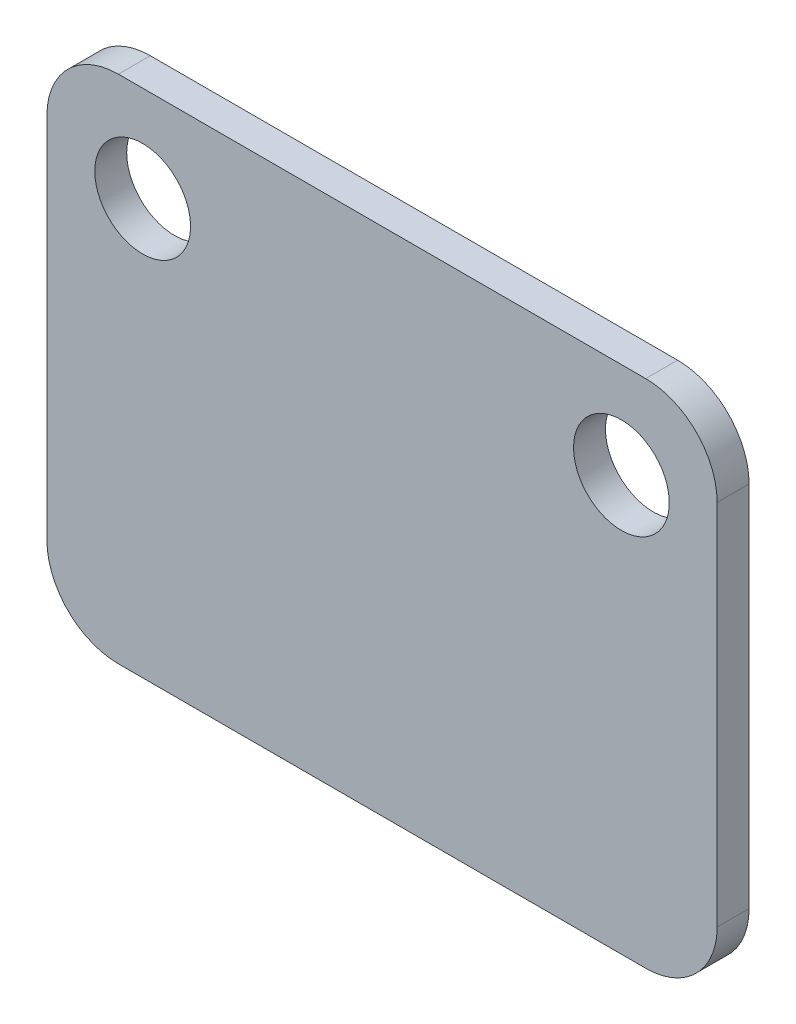
ISO-10303-21;
HEADER;
FILE_DESCRIPTION(('STEP AP214'),'2;1');
FILE_NAME('part.step','',(''),(''),'','','');
FILE_SCHEMA(('AUTOMOTIVE_DESIGN { 1 0 10303 214 1 1 1 1 }'));
ENDSEC;
DATA;
#1=APPLICATION_CONTEXT('core data for automotive mechanical design processes');
#2=APPLICATION_PROTOCOL_DEFINITION('international standard','automotive_design',2000,#1);
#3=PRODUCT_CONTEXT('',#1,'mechanical');
#4=PRODUCT('Part','Part','',(#3));
#5=PRODUCT_RELATED_PRODUCT_CATEGORY('part','',(#4));
#6=PRODUCT_DEFINITION_FORMATION('','',#4);
#7=PRODUCT_DEFINITION_CONTEXT('part definition',#1,'design');
#8=PRODUCT_DEFINITION('design','',#6,#7);
#9=PRODUCT_DEFINITION_SHAPE('','',#8);
#10=(LENGTH_UNIT() NAMED_UNIT(*) SI_UNIT(.MILLI.,.METRE.));
#11=(NAMED_UNIT(*) PLANE_ANGLE_UNIT() SI_UNIT($,.RADIAN.));
#12=(NAMED_UNIT(*) SI_UNIT($,.STERADIAN.) SOLID_ANGLE_UNIT());
#13=UNCERTAINTY_MEASURE_WITH_UNIT(LENGTH_MEASURE(1.E-05),#10,'distance_accuracy_value','');
#14=(GEOMETRIC_REPRESENTATION_CONTEXT(3) GLOBAL_UNCERTAINTY_ASSIGNED_CONTEXT((#13)) GLOBAL_UNIT_ASSIGNED_CONTEXT((#10,
#11,#12)) REPRESENTATION_CONTEXT('',''));
#15=CARTESIAN_POINT('',(0.,0.,0.));
#16=DIRECTION('',(0.,0.,1.));
#17=DIRECTION('',(1.,0.,0.));
#18=AXIS2_PLACEMENT_3D('',#15,#16,#17);
#19=CARTESIAN_POINT('',(71.3519103433022,946.816430092348,1.));
#20=DIRECTION('',(0.,0.,-1.));
#21=DIRECTION('',(-1.,0.,0.));
#22=AXIS2_PLACEMENT_3D('',#19,#20,#21);
#23=CYLINDRICAL_SURFACE('',#22,2.24000000000001);
#24=CARTESIAN_POINT('',(71.3519103433022,946.816430092348,0.));
#25=DIRECTION('',(0.,0.,-1.));
#26=DIRECTION('',(-1.,0.,0.));
#27=AXIS2_PLACEMENT_3D('',#24,#25,#26);
#28=CIRCLE('',#27,2.24000000000001);
#29=CARTESIAN_POINT('',(71.3519103433022,949.056430092348,0.));
#30=VERTEX_POINT('',#29);
#31=CARTESIAN_POINT('',(73.5919103433022,946.816430092348,0.));
#32=VERTEX_POINT('',#31);
#33=EDGE_CURVE('E132',#30,#32,#28,.T.);
#34=ORIENTED_EDGE('',*,*,#33,.F.);
#35=DIRECTION('',(0.,0.,-1.));
#36=VECTOR('',#35,1.);
#37=CARTESIAN_POINT('',(71.3519103433022,949.056430092348,1.));
#38=LINE('',#37,#36);
#39=CARTESIAN_POINT('',(71.3519103433022,949.056430092348,1.));
#40=VERTEX_POINT('',#39);
#41=EDGE_CURVE('E11',#40,#30,#38,.T.);
#42=ORIENTED_EDGE('',*,*,#41,.F.);
#43=CARTESIAN_POINT('',(71.3519103433022,946.816430092348,1.));
#44=DIRECTION('',(0.,0.,-1.));
#45=DIRECTION('',(-1.,0.,0.));
#46=AXIS2_PLACEMENT_3D('',#43,#44,#45);
#47=CIRCLE('',#46,2.24000000000001);
#48=CARTESIAN_POINT('',(73.5919103433022,946.816430092348,1.));
#49=VERTEX_POINT('',#48);
#50=EDGE_CURVE('E151',#40,#49,#47,.T.);
#51=ORIENTED_EDGE('',*,*,#50,.T.);
#52=DIRECTION('',(0.,0.,-1.));
#53=VECTOR('',#52,1.);
#54=CARTESIAN_POINT('',(73.5919103433022,946.816430092348,1.));
#55=LINE('',#54,#53);
#56=EDGE_CURVE('E36',#49,#32,#55,.T.);
#57=ORIENTED_EDGE('',*,*,#56,.T.);
#58=EDGE_LOOP('',(#34,#42,#51,#57));
#59=FACE_BOUND('',#58,.T.);
#60=ADVANCED_FACE('F33',(#59),#23,.T.);
#61=CARTESIAN_POINT('',(71.3519103433022,949.056430092348,1.));
#62=DIRECTION('',(0.,-1.,0.));
#63=DIRECTION('',(0.,0.,-1.));
#64=AXIS2_PLACEMENT_3D('',#61,#62,#63);
#65=PLANE('',#64);
#66=DIRECTION('',(-1.,0.,0.));
#67=VECTOR('',#66,1.);
#68=CARTESIAN_POINT('',(71.3519103433022,949.056430092348,0.));
#69=LINE('',#68,#67);
#70=CARTESIAN_POINT('',(54.8319103433022,949.056430092348,0.));
#71=VERTEX_POINT('',#70);
#72=EDGE_CURVE('E78',#30,#71,#69,.T.);
#73=ORIENTED_EDGE('',*,*,#72,.T.);
#74=DIRECTION('',(0.,0.,-1.));
#75=VECTOR('',#74,1.);
#76=CARTESIAN_POINT('',(54.8319103433022,949.056430092348,1.));
#77=LINE('',#76,#75);
#78=CARTESIAN_POINT('',(54.8319103433022,949.056430092348,1.));
#79=VERTEX_POINT('',#78);
#80=EDGE_CURVE('E42',#79,#71,#77,.T.);
#81=ORIENTED_EDGE('',*,*,#80,.F.);
#82=DIRECTION('',(-1.,0.,0.));
#83=VECTOR('',#82,1.);
#84=CARTESIAN_POINT('',(71.3519103433022,949.056430092348,1.));
#85=LINE('',#84,#83);
#86=EDGE_CURVE('E110',#40,#79,#85,.T.);
#87=ORIENTED_EDGE('',*,*,#86,.F.);
#88=ORIENTED_EDGE('',*,*,#41,.T.);
#89=EDGE_LOOP('',(#73,#81,#87,#88));
#90=FACE_BOUND('',#89,.T.);
#91=ADVANCED_FACE('F213',(#90),#65,.F.);
#92=CARTESIAN_POINT('',(54.8319103433022,946.816430092348,1.));
#93=DIRECTION('',(0.,0.,-1.));
#94=DIRECTION('',(-1.,0.,0.));
#95=AXIS2_PLACEMENT_3D('',#92,#93,#94);
#96=CYLINDRICAL_SURFACE('',#95,2.24000000000001);
#97=CARTESIAN_POINT('',(54.8319103433022,946.816430092348,0.));
#98=DIRECTION('',(0.,0.,1.));
#99=DIRECTION('',(1.,0.,0.));
#100=AXIS2_PLACEMENT_3D('',#97,#98,#99);
#101=CIRCLE('',#100,2.24000000000001);
#102=CARTESIAN_POINT('',(52.5919103433022,946.816430092348,0.));
#103=VERTEX_POINT('',#102);
#104=EDGE_CURVE('E117',#71,#103,#101,.T.);
#105=ORIENTED_EDGE('',*,*,#104,.T.);
#106=DIRECTION('',(0.,0.,-1.));
#107=VECTOR('',#106,1.);
#108=CARTESIAN_POINT('',(52.5919103433022,946.816430092348,1.));
#109=LINE('',#108,#107);
#110=CARTESIAN_POINT('',(52.5919103433022,946.816430092348,1.));
#111=VERTEX_POINT('',#110);
#112=EDGE_CURVE('E114',#111,#103,#109,.T.);
#113=ORIENTED_EDGE('',*,*,#112,.F.);
#114=CARTESIAN_POINT('',(54.8319103433022,946.816430092348,1.));
#115=DIRECTION('',(0.,0.,1.));
#116=DIRECTION('',(1.,0.,0.));
#117=AXIS2_PLACEMENT_3D('',#114,#115,#116);
#118=CIRCLE('',#117,2.24000000000001);
#119=EDGE_CURVE('E102',#79,#111,#118,.T.);
#120=ORIENTED_EDGE('',*,*,#119,.F.);
#121=ORIENTED_EDGE('',*,*,#80,.T.);
#122=EDGE_LOOP('',(#105,#113,#120,#121));
#123=FACE_BOUND('',#122,.T.);
#124=ADVANCED_FACE('F115',(#123),#96,.T.);
#125=CARTESIAN_POINT('',(52.5919103433022,946.816430092348,1.));
#126=DIRECTION('',(1.,0.,0.));
#127=DIRECTION('',(0.,0.,-1.));
#128=AXIS2_PLACEMENT_3D('',#125,#126,#127);
#129=PLANE('',#128);
#130=DIRECTION('',(0.,-1.,0.));
#131=VECTOR('',#130,1.);
#132=CARTESIAN_POINT('',(52.5919103433022,946.816430092348,0.));
#133=LINE('',#132,#131);
#134=CARTESIAN_POINT('',(52.5919103433022,935.296430092348,0.));
#135=VERTEX_POINT('',#134);
#136=EDGE_CURVE('E148',#103,#135,#133,.T.);
#137=ORIENTED_EDGE('',*,*,#136,.T.);
#138=DIRECTION('',(0.,0.,-1.));
#139=VECTOR('',#138,1.);
#140=CARTESIAN_POINT('',(52.5919103433022,935.296430092348,1.));
#141=LINE('',#140,#139);
#142=CARTESIAN_POINT('',(52.5919103433022,935.296430092348,1.));
#143=VERTEX_POINT('',#142);
#144=EDGE_CURVE('E121',#143,#135,#141,.T.);
#145=ORIENTED_EDGE('',*,*,#144,.F.);
#146=DIRECTION('',(0.,-1.,0.));
#147=VECTOR('',#146,1.);
#148=CARTESIAN_POINT('',(52.5919103433022,946.816430092348,1.));
#149=LINE('',#148,#147);
#150=EDGE_CURVE('E108',#111,#143,#149,.T.);
#151=ORIENTED_EDGE('',*,*,#150,.F.);
#152=ORIENTED_EDGE('',*,*,#112,.T.);
#153=EDGE_LOOP('',(#137,#145,#151,#152));
#154=FACE_BOUND('',#153,.T.);
#155=ADVANCED_FACE('F123',(#154),#129,.F.);
#156=CARTESIAN_POINT('',(54.8319103433022,935.296430092348,1.));
#157=DIRECTION('',(0.,0.,-1.));
#158=DIRECTION('',(-1.,0.,0.));
#159=AXIS2_PLACEMENT_3D('',#156,#157,#158);
#160=CYLINDRICAL_SURFACE('',#159,2.24000000000001);
#161=CARTESIAN_POINT('',(54.8319103433022,935.296430092348,0.));
#162=DIRECTION('',(0.,0.,-1.));
#163=DIRECTION('',(-1.,0.,0.));
#164=AXIS2_PLACEMENT_3D('',#161,#162,#163);
#165=CIRCLE('',#164,2.24000000000001);
#166=CARTESIAN_POINT('',(54.8319103433022,933.056430092348,0.));
#167=VERTEX_POINT('',#166);
#168=EDGE_CURVE('E145',#167,#135,#165,.T.);
#169=ORIENTED_EDGE('',*,*,#168,.F.);
#170=DIRECTION('',(0.,0.,-1.));
#171=VECTOR('',#170,1.);
#172=CARTESIAN_POINT('',(54.8319103433022,933.056430092348,1.));
#173=LINE('',#172,#171);
#174=CARTESIAN_POINT('',(54.8319103433022,933.056430092348,1.));
#175=VERTEX_POINT('',#174);
#176=EDGE_CURVE('E155',#175,#167,#173,.T.);
#177=ORIENTED_EDGE('',*,*,#176,.F.);
#178=CARTESIAN_POINT('',(54.8319103433022,935.296430092348,1.));
#179=DIRECTION('',(0.,0.,-1.));
#180=DIRECTION('',(-1.,0.,0.));
#181=AXIS2_PLACEMENT_3D('',#178,#179,#180);
#182=CIRCLE('',#181,2.24000000000001);
#183=EDGE_CURVE('E125',#175,#143,#182,.T.);
#184=ORIENTED_EDGE('',*,*,#183,.T.);
#185=ORIENTED_EDGE('',*,*,#144,.T.);
#186=EDGE_LOOP('',(#169,#177,#184,#185));
#187=FACE_BOUND('',#186,.T.);
#188=ADVANCED_FACE('F166',(#187),#160,.T.);
#189=CARTESIAN_POINT('',(71.3519103433022,933.056430092348,1.));
#190=DIRECTION('',(0.,-1.,0.));
#191=DIRECTION('',(0.,0.,-1.));
#192=AXIS2_PLACEMENT_3D('',#189,#190,#191);
#193=PLANE('',#192);
#194=DIRECTION('',(-1.,0.,0.));
#195=VECTOR('',#194,1.);
#196=CARTESIAN_POINT('',(71.3519103433022,933.056430092348,0.));
#197=LINE('',#196,#195);
#198=CARTESIAN_POINT('',(71.3519103433022,933.056430092348,0.));
#199=VERTEX_POINT('',#198);
#200=EDGE_CURVE('E142',#199,#167,#197,.T.);
#201=ORIENTED_EDGE('',*,*,#200,.F.);
#202=DIRECTION('',(0.,0.,-1.));
#203=VECTOR('',#202,1.);
#204=CARTESIAN_POINT('',(71.3519103433022,933.056430092348,1.));
#205=LINE('',#204,#203);
#206=CARTESIAN_POINT('',(71.3519103433022,933.056430092348,1.));
#207=VERTEX_POINT('',#206);
#208=EDGE_CURVE('E157',#207,#199,#205,.T.);
#209=ORIENTED_EDGE('',*,*,#208,.F.);
#210=DIRECTION('',(-1.,0.,0.));
#211=VECTOR('',#210,1.);
#212=CARTESIAN_POINT('',(71.3519103433022,933.056430092348,1.));
#213=LINE('',#212,#211);
#214=EDGE_CURVE('E127',#207,#175,#213,.T.);
#215=ORIENTED_EDGE('',*,*,#214,.T.);
#216=ORIENTED_EDGE('',*,*,#176,.T.);
#217=EDGE_LOOP('',(#201,#209,#215,#216));
#218=FACE_BOUND('',#217,.T.);
#219=ADVANCED_FACE('F172',(#218),#193,.T.);
#220=CARTESIAN_POINT('',(71.3519103433022,935.296430092348,1.));
#221=DIRECTION('',(0.,0.,-1.));
#222=DIRECTION('',(-1.,0.,0.));
#223=AXIS2_PLACEMENT_3D('',#220,#221,#222);
#224=CYLINDRICAL_SURFACE('',#223,2.24000000000001);
#225=CARTESIAN_POINT('',(71.3519103433022,935.296430092348,0.));
#226=DIRECTION('',(0.,0.,-1.));
#227=DIRECTION('',(-1.,0.,0.));
#228=AXIS2_PLACEMENT_3D('',#225,#226,#227);
#229=CIRCLE('',#228,2.24000000000001);
#230=CARTESIAN_POINT('',(73.5919103433022,935.296430092348,0.));
#231=VERTEX_POINT('',#230);
#232=EDGE_CURVE('E139',#231,#199,#229,.T.);
#233=ORIENTED_EDGE('',*,*,#232,.F.);
#234=DIRECTION('',(0.,0.,-1.));
#235=VECTOR('',#234,1.);
#236=CARTESIAN_POINT('',(73.5919103433022,935.296430092348,1.));
#237=LINE('',#236,#235);
#238=CARTESIAN_POINT('',(73.5919103433022,935.296430092348,1.));
#239=VERTEX_POINT('',#238);
#240=EDGE_CURVE('E158',#239,#231,#237,.T.);
#241=ORIENTED_EDGE('',*,*,#240,.F.);
#242=CARTESIAN_POINT('',(71.3519103433022,935.296430092348,1.));
#243=DIRECTION('',(0.,0.,-1.));
#244=DIRECTION('',(-1.,0.,0.));
#245=AXIS2_PLACEMENT_3D('',#242,#243,#244);
#246=CIRCLE('',#245,2.24000000000001);
#247=EDGE_CURVE('E173',#239,#207,#246,.T.);
#248=ORIENTED_EDGE('',*,*,#247,.T.);
#249=ORIENTED_EDGE('',*,*,#208,.T.);
#250=EDGE_LOOP('',(#233,#241,#248,#249));
#251=FACE_BOUND('',#250,.T.);
#252=ADVANCED_FACE('F211',(#251),#224,.T.);
#253=CARTESIAN_POINT('',(73.5919103433022,946.816430092348,1.));
#254=DIRECTION('',(1.,0.,0.));
#255=DIRECTION('',(0.,0.,-1.));
#256=AXIS2_PLACEMENT_3D('',#253,#254,#255);
#257=PLANE('',#256);
#258=DIRECTION('',(0.,-1.,0.));
#259=VECTOR('',#258,1.);
#260=CARTESIAN_POINT('',(73.5919103433022,946.816430092348,0.));
#261=LINE('',#260,#259);
#262=EDGE_CURVE('E135',#32,#231,#261,.T.);
#263=ORIENTED_EDGE('',*,*,#262,.F.);
#264=ORIENTED_EDGE('',*,*,#56,.F.);
#265=DIRECTION('',(0.,-1.,0.));
#266=VECTOR('',#265,1.);
#267=CARTESIAN_POINT('',(73.5919103433022,946.816430092348,1.));
#268=LINE('',#267,#266);
#269=EDGE_CURVE('E174',#49,#239,#268,.T.);
#270=ORIENTED_EDGE('',*,*,#269,.T.);
#271=ORIENTED_EDGE('',*,*,#240,.T.);
#272=EDGE_LOOP('',(#263,#264,#270,#271));
#273=FACE_BOUND('',#272,.T.);
#274=ADVANCED_FACE('F160',(#273),#257,.T.);
#275=CARTESIAN_POINT('',(71.3519103433022,946.816430092348,1.));
#276=DIRECTION('',(0.,0.,-1.));
#277=DIRECTION('',(-1.,0.,0.));
#278=AXIS2_PLACEMENT_3D('',#275,#276,#277);
#279=PLANE('',#278);
#280=CARTESIAN_POINT('',(70.5919103433022,946.056430092348,1.));
#281=DIRECTION('',(0.,0.,-1.));
#282=DIRECTION('',(-1.,0.,0.));
#283=AXIS2_PLACEMENT_3D('',#280,#281,#282);
#284=CIRCLE('',#283,1.5);
#285=CARTESIAN_POINT('',(69.0919103433022,946.056430092348,1.));
#286=VERTEX_POINT('',#285);
#287=EDGE_CURVE('E184',#286,#286,#284,.T.);
#288=ORIENTED_EDGE('',*,*,#287,.T.);
#289=EDGE_LOOP('',(#288));
#290=FACE_BOUND('',#289,.T.);
#291=CARTESIAN_POINT('',(55.5919103433022,946.056430092348,1.));
#292=DIRECTION('',(0.,0.,-1.));
#293=DIRECTION('',(-1.,0.,0.));
#294=AXIS2_PLACEMENT_3D('',#291,#292,#293);
#295=CIRCLE('',#294,1.5);
#296=CARTESIAN_POINT('',(54.0919103433022,946.056430092348,1.));
#297=VERTEX_POINT('',#296);
#298=EDGE_CURVE('E136',#297,#297,#295,.T.);
#299=ORIENTED_EDGE('',*,*,#298,.T.);
#300=EDGE_LOOP('',(#299));
#301=FACE_BOUND('',#300,.T.);
#302=ORIENTED_EDGE('',*,*,#50,.F.);
#303=ORIENTED_EDGE('',*,*,#86,.T.);
#304=ORIENTED_EDGE('',*,*,#119,.T.);
#305=ORIENTED_EDGE('',*,*,#150,.T.);
#306=ORIENTED_EDGE('',*,*,#183,.F.);
#307=ORIENTED_EDGE('',*,*,#214,.F.);
#308=ORIENTED_EDGE('',*,*,#247,.F.);
#309=ORIENTED_EDGE('',*,*,#269,.F.);
#310=EDGE_LOOP('',(#302,#303,#304,#305,#306,#307,#308,#309));
#311=FACE_BOUND('',#310,.T.);
#312=ADVANCED_FACE('F105',(#290,#301,#311),#279,.F.);
#313=CARTESIAN_POINT('',(71.3519103433022,946.816430092348,0.));
#314=DIRECTION('',(0.,0.,-1.));
#315=DIRECTION('',(-1.,0.,0.));
#316=AXIS2_PLACEMENT_3D('',#313,#314,#315);
#317=PLANE('',#316);
#318=CARTESIAN_POINT('',(70.5919103433022,946.056430092348,0.));
#319=DIRECTION('',(0.,0.,-1.));
#320=DIRECTION('',(-1.,0.,0.));
#321=AXIS2_PLACEMENT_3D('',#318,#319,#320);
#322=CIRCLE('',#321,1.5);
#323=CARTESIAN_POINT('',(69.0919103433022,946.056430092348,0.));
#324=VERTEX_POINT('',#323);
#325=EDGE_CURVE('E187',#324,#324,#322,.T.);
#326=ORIENTED_EDGE('',*,*,#325,.F.);
#327=EDGE_LOOP('',(#326));
#328=FACE_BOUND('',#327,.T.);
#329=CARTESIAN_POINT('',(55.5919103433022,946.056430092348,0.));
#330=DIRECTION('',(0.,0.,-1.));
#331=DIRECTION('',(-1.,0.,0.));
#332=AXIS2_PLACEMENT_3D('',#329,#330,#331);
#333=CIRCLE('',#332,1.5);
#334=CARTESIAN_POINT('',(54.0919103433022,946.056430092348,0.));
#335=VERTEX_POINT('',#334);
#336=EDGE_CURVE('E181',#335,#335,#333,.T.);
#337=ORIENTED_EDGE('',*,*,#336,.F.);
#338=EDGE_LOOP('',(#337));
#339=FACE_BOUND('',#338,.T.);
#340=ORIENTED_EDGE('',*,*,#33,.T.);
#341=ORIENTED_EDGE('',*,*,#262,.T.);
#342=ORIENTED_EDGE('',*,*,#232,.T.);
#343=ORIENTED_EDGE('',*,*,#200,.T.);
#344=ORIENTED_EDGE('',*,*,#168,.T.);
#345=ORIENTED_EDGE('',*,*,#136,.F.);
#346=ORIENTED_EDGE('',*,*,#104,.F.);
#347=ORIENTED_EDGE('',*,*,#72,.F.);
#348=EDGE_LOOP('',(#340,#341,#342,#343,#344,#345,#346,#347));
#349=FACE_BOUND('',#348,.T.);
#350=ADVANCED_FACE('F162',(#328,#339,#349),#317,.T.);
#351=CARTESIAN_POINT('',(55.5919103433022,946.056430092348,3.));
#352=DIRECTION('',(0.,0.,-1.));
#353=DIRECTION('',(-1.,0.,0.));
#354=AXIS2_PLACEMENT_3D('',#351,#352,#353);
#355=CYLINDRICAL_SURFACE('',#354,1.5);
#356=ORIENTED_EDGE('',*,*,#336,.T.);
#357=EDGE_LOOP('',(#356));
#358=FACE_BOUND('',#357,.T.);
#359=ORIENTED_EDGE('',*,*,#298,.F.);
#360=EDGE_LOOP('',(#359));
#361=FACE_BOUND('',#360,.T.);
#362=ADVANCED_FACE('F196',(#358,#361),#355,.F.);
#363=CARTESIAN_POINT('',(70.5919103433022,946.056430092348,3.));
#364=DIRECTION('',(0.,0.,-1.));
#365=DIRECTION('',(-1.,0.,0.));
#366=AXIS2_PLACEMENT_3D('',#363,#364,#365);
#367=CYLINDRICAL_SURFACE('',#366,1.5);
#368=ORIENTED_EDGE('',*,*,#325,.T.);
#369=EDGE_LOOP('',(#368));
#370=FACE_BOUND('',#369,.T.);
#371=ORIENTED_EDGE('',*,*,#287,.F.);
#372=EDGE_LOOP('',(#371));
#373=FACE_BOUND('',#372,.T.);
#374=ADVANCED_FACE('F191',(#370,#373),#367,.F.);
#375=CLOSED_SHELL('',(#60,#91,#124,#155,#188,#219,#252,#274,#312,#350,#362,#374));
#376=MANIFOLD_SOLID_BREP('B2',#375);
#377=ADVANCED_BREP_SHAPE_REPRESENTATION('',(#18,#376),#14);
#378=SHAPE_DEFINITION_REPRESENTATION(#9,#377);
ENDSEC;
END-ISO-10303-21;
